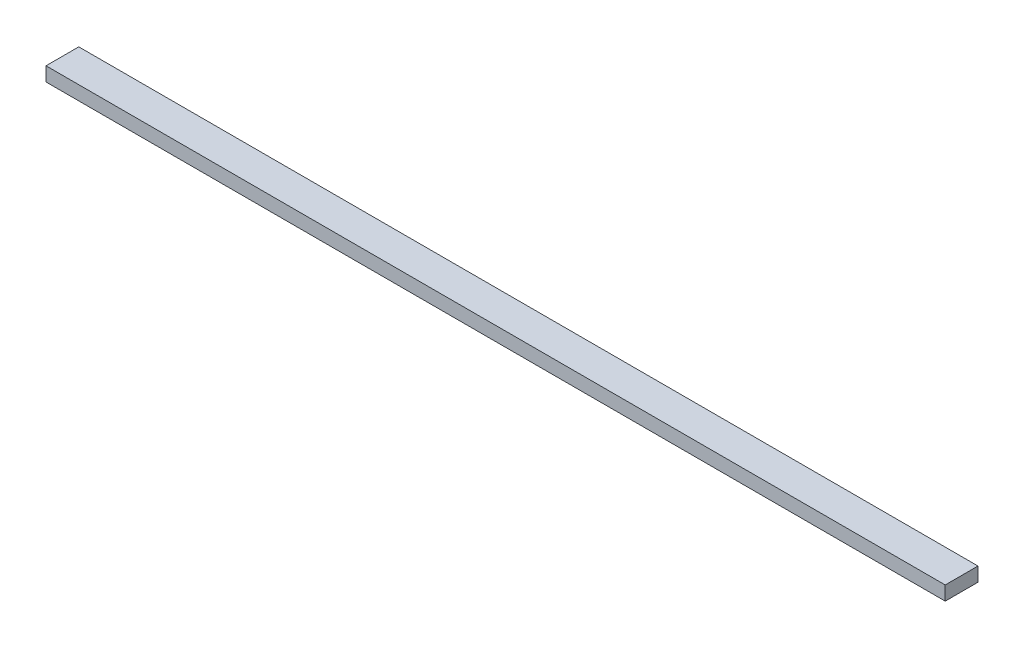
ISO-10303-21;
HEADER;
FILE_DESCRIPTION(('STEP AP214'),'2;1');
FILE_NAME('part.step','',(''),(''),'','','');
FILE_SCHEMA(('AUTOMOTIVE_DESIGN { 1 0 10303 214 1 1 1 1 }'));
ENDSEC;
DATA;
#1=APPLICATION_CONTEXT('core data for automotive mechanical design processes');
#2=APPLICATION_PROTOCOL_DEFINITION('international standard','automotive_design',2000,#1);
#3=PRODUCT_CONTEXT('',#1,'mechanical');
#4=PRODUCT('Part','Part','',(#3));
#5=PRODUCT_RELATED_PRODUCT_CATEGORY('part','',(#4));
#6=PRODUCT_DEFINITION_FORMATION('','',#4);
#7=PRODUCT_DEFINITION_CONTEXT('part definition',#1,'design');
#8=PRODUCT_DEFINITION('design','',#6,#7);
#9=PRODUCT_DEFINITION_SHAPE('','',#8);
#10=(LENGTH_UNIT() NAMED_UNIT(*) SI_UNIT(.MILLI.,.METRE.));
#11=(NAMED_UNIT(*) PLANE_ANGLE_UNIT() SI_UNIT($,.RADIAN.));
#12=(NAMED_UNIT(*) SI_UNIT($,.STERADIAN.) SOLID_ANGLE_UNIT());
#13=UNCERTAINTY_MEASURE_WITH_UNIT(LENGTH_MEASURE(1.E-05),#10,'distance_accuracy_value','');
#14=(GEOMETRIC_REPRESENTATION_CONTEXT(3) GLOBAL_UNCERTAINTY_ASSIGNED_CONTEXT((#13)) GLOBAL_UNIT_ASSIGNED_CONTEXT((#10,
#11,#12)) REPRESENTATION_CONTEXT('',''));
#15=CARTESIAN_POINT('',(0.,0.,0.));
#16=DIRECTION('',(0.,0.,1.));
#17=DIRECTION('',(1.,0.,0.));
#18=AXIS2_PLACEMENT_3D('',#15,#16,#17);
#19=CARTESIAN_POINT('',(0.,-38.1000000000003,88.9));
#20=DIRECTION('',(-1.,0.,0.));
#21=DIRECTION('',(0.,0.,1.));
#22=AXIS2_PLACEMENT_3D('',#19,#20,#21);
#23=PLANE('',#22);
#24=DIRECTION('',(0.,1.,0.));
#25=VECTOR('',#24,1.);
#26=CARTESIAN_POINT('',(0.,-38.1000000000003,0.));
#27=LINE('',#26,#25);
#28=CARTESIAN_POINT('',(0.,-38.1000000000003,0.));
#29=VERTEX_POINT('',#28);
#30=CARTESIAN_POINT('',(0.,0.,0.));
#31=VERTEX_POINT('',#30);
#32=EDGE_CURVE('E99',#29,#31,#27,.T.);
#33=ORIENTED_EDGE('',*,*,#32,.T.);
#34=DIRECTION('',(0.,0.,-1.));
#35=VECTOR('',#34,1.);
#36=CARTESIAN_POINT('',(0.,0.,88.9));
#37=LINE('',#36,#35);
#38=CARTESIAN_POINT('',(0.,0.,88.9));
#39=VERTEX_POINT('',#38);
#40=EDGE_CURVE('E11',#39,#31,#37,.T.);
#41=ORIENTED_EDGE('',*,*,#40,.F.);
#42=DIRECTION('',(0.,1.,0.));
#43=VECTOR('',#42,1.);
#44=CARTESIAN_POINT('',(0.,-38.1000000000003,88.9));
#45=LINE('',#44,#43);
#46=CARTESIAN_POINT('',(0.,-38.1000000000003,88.9));
#47=VERTEX_POINT('',#46);
#48=EDGE_CURVE('E87',#47,#39,#45,.T.);
#49=ORIENTED_EDGE('',*,*,#48,.F.);
#50=DIRECTION('',(0.,0.,-1.));
#51=VECTOR('',#50,1.);
#52=CARTESIAN_POINT('',(0.,-38.1000000000003,88.9));
#53=LINE('',#52,#51);
#54=EDGE_CURVE('E95',#47,#29,#53,.T.);
#55=ORIENTED_EDGE('',*,*,#54,.T.);
#56=EDGE_LOOP('',(#33,#41,#49,#55));
#57=FACE_BOUND('',#56,.T.);
#58=ADVANCED_FACE('F36',(#57),#23,.F.);
#59=CARTESIAN_POINT('',(0.,0.,88.9));
#60=DIRECTION('',(0.,-1.,0.));
#61=DIRECTION('',(1.,0.,0.));
#62=AXIS2_PLACEMENT_3D('',#59,#60,#61);
#63=PLANE('',#62);
#64=DIRECTION('',(-1.,0.,0.));
#65=VECTOR('',#64,1.);
#66=CARTESIAN_POINT('',(0.,0.,0.));
#67=LINE('',#66,#65);
#68=CARTESIAN_POINT('',(-2438.4,-2.98617875504091E-13,0.));
#69=VERTEX_POINT('',#68);
#70=EDGE_CURVE('E91',#31,#69,#67,.T.);
#71=ORIENTED_EDGE('',*,*,#70,.T.);
#72=DIRECTION('',(0.,0.,-1.));
#73=VECTOR('',#72,1.);
#74=CARTESIAN_POINT('',(-2438.4,-2.98617875504091E-13,88.9));
#75=LINE('',#74,#73);
#76=CARTESIAN_POINT('',(-2438.4,-2.98617875504091E-13,88.9));
#77=VERTEX_POINT('',#76);
#78=EDGE_CURVE('E44',#77,#69,#75,.T.);
#79=ORIENTED_EDGE('',*,*,#78,.F.);
#80=DIRECTION('',(-1.,0.,0.));
#81=VECTOR('',#80,1.);
#82=CARTESIAN_POINT('',(0.,0.,88.9));
#83=LINE('',#82,#81);
#84=EDGE_CURVE('E82',#39,#77,#83,.T.);
#85=ORIENTED_EDGE('',*,*,#84,.F.);
#86=ORIENTED_EDGE('',*,*,#40,.T.);
#87=EDGE_LOOP('',(#71,#79,#85,#86));
#88=FACE_BOUND('',#87,.T.);
#89=ADVANCED_FACE('F90',(#88),#63,.F.);
#90=CARTESIAN_POINT('',(-2438.4,-2.98617875504091E-13,88.9));
#91=DIRECTION('',(1.,0.,0.));
#92=DIRECTION('',(0.,0.,-1.));
#93=AXIS2_PLACEMENT_3D('',#90,#91,#92);
#94=PLANE('',#93);
#95=DIRECTION('',(0.,-1.,0.));
#96=VECTOR('',#95,1.);
#97=CARTESIAN_POINT('',(-2438.4,-2.98617875504091E-13,0.));
#98=LINE('',#97,#96);
#99=CARTESIAN_POINT('',(-2438.4,-38.1000000000003,0.));
#100=VERTEX_POINT('',#99);
#101=EDGE_CURVE('E69',#69,#100,#98,.T.);
#102=ORIENTED_EDGE('',*,*,#101,.T.);
#103=DIRECTION('',(0.,0.,-1.));
#104=VECTOR('',#103,1.);
#105=CARTESIAN_POINT('',(-2438.4,-38.1000000000003,88.9));
#106=LINE('',#105,#104);
#107=CARTESIAN_POINT('',(-2438.4,-38.1000000000003,88.9));
#108=VERTEX_POINT('',#107);
#109=EDGE_CURVE('E92',#108,#100,#106,.T.);
#110=ORIENTED_EDGE('',*,*,#109,.F.);
#111=DIRECTION('',(0.,-1.,0.));
#112=VECTOR('',#111,1.);
#113=CARTESIAN_POINT('',(-2438.4,-2.98617875504091E-13,88.9));
#114=LINE('',#113,#112);
#115=EDGE_CURVE('E85',#77,#108,#114,.T.);
#116=ORIENTED_EDGE('',*,*,#115,.F.);
#117=ORIENTED_EDGE('',*,*,#78,.T.);
#118=EDGE_LOOP('',(#102,#110,#116,#117));
#119=FACE_BOUND('',#118,.T.);
#120=ADVANCED_FACE('F93',(#119),#94,.F.);
#121=CARTESIAN_POINT('',(-2438.4,-38.1000000000003,88.9));
#122=DIRECTION('',(0.,1.,0.));
#123=DIRECTION('',(0.,0.,1.));
#124=AXIS2_PLACEMENT_3D('',#121,#122,#123);
#125=PLANE('',#124);
#126=DIRECTION('',(1.,0.,0.));
#127=VECTOR('',#126,1.);
#128=CARTESIAN_POINT('',(-2438.4,-38.1000000000003,0.));
#129=LINE('',#128,#127);
#130=EDGE_CURVE('E75',#100,#29,#129,.T.);
#131=ORIENTED_EDGE('',*,*,#130,.T.);
#132=ORIENTED_EDGE('',*,*,#54,.F.);
#133=DIRECTION('',(1.,0.,0.));
#134=VECTOR('',#133,1.);
#135=CARTESIAN_POINT('',(-2438.4,-38.1000000000003,88.9));
#136=LINE('',#135,#134);
#137=EDGE_CURVE('E52',#108,#47,#136,.T.);
#138=ORIENTED_EDGE('',*,*,#137,.F.);
#139=ORIENTED_EDGE('',*,*,#109,.T.);
#140=EDGE_LOOP('',(#131,#132,#138,#139));
#141=FACE_BOUND('',#140,.T.);
#142=ADVANCED_FACE('F106',(#141),#125,.F.);
#143=CARTESIAN_POINT('',(0.,0.,88.9));
#144=DIRECTION('',(0.,0.,1.));
#145=DIRECTION('',(1.,0.,0.));
#146=AXIS2_PLACEMENT_3D('',#143,#144,#145);
#147=PLANE('',#146);
#148=ORIENTED_EDGE('',*,*,#48,.T.);
#149=ORIENTED_EDGE('',*,*,#84,.T.);
#150=ORIENTED_EDGE('',*,*,#115,.T.);
#151=ORIENTED_EDGE('',*,*,#137,.T.);
#152=EDGE_LOOP('',(#148,#149,#150,#151));
#153=FACE_BOUND('',#152,.T.);
#154=ADVANCED_FACE('F83',(#153),#147,.T.);
#155=CARTESIAN_POINT('',(0.,0.,0.));
#156=DIRECTION('',(0.,0.,1.));
#157=DIRECTION('',(1.,0.,0.));
#158=AXIS2_PLACEMENT_3D('',#155,#156,#157);
#159=PLANE('',#158);
#160=ORIENTED_EDGE('',*,*,#32,.F.);
#161=ORIENTED_EDGE('',*,*,#130,.F.);
#162=ORIENTED_EDGE('',*,*,#101,.F.);
#163=ORIENTED_EDGE('',*,*,#70,.F.);
#164=EDGE_LOOP('',(#160,#161,#162,#163));
#165=FACE_BOUND('',#164,.T.);
#166=ADVANCED_FACE('F109',(#165),#159,.F.);
#167=CLOSED_SHELL('',(#58,#89,#120,#142,#154,#166));
#168=MANIFOLD_SOLID_BREP('B2',#167);
#169=ADVANCED_BREP_SHAPE_REPRESENTATION('',(#18,#168),#14);
#170=SHAPE_DEFINITION_REPRESENTATION(#9,#169);
ENDSEC;
END-ISO-10303-21;
